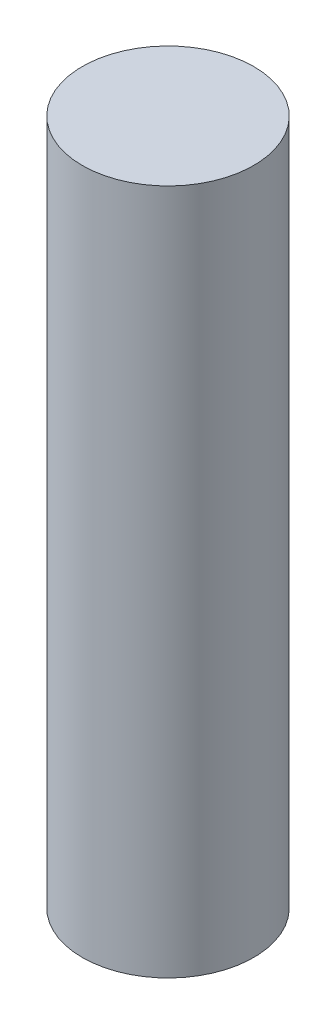
ISO-10303-21;
HEADER;
FILE_DESCRIPTION(('STEP AP214'),'2;1');
FILE_NAME('part.step','',(''),(''),'','','');
FILE_SCHEMA(('AUTOMOTIVE_DESIGN { 1 0 10303 214 1 1 1 1 }'));
ENDSEC;
DATA;
#1=APPLICATION_CONTEXT('core data for automotive mechanical design processes');
#2=APPLICATION_PROTOCOL_DEFINITION('international standard','automotive_design',2000,#1);
#3=PRODUCT_CONTEXT('',#1,'mechanical');
#4=PRODUCT('Part','Part','',(#3));
#5=PRODUCT_RELATED_PRODUCT_CATEGORY('part','',(#4));
#6=PRODUCT_DEFINITION_FORMATION('','',#4);
#7=PRODUCT_DEFINITION_CONTEXT('part definition',#1,'design');
#8=PRODUCT_DEFINITION('design','',#6,#7);
#9=PRODUCT_DEFINITION_SHAPE('','',#8);
#10=(LENGTH_UNIT() NAMED_UNIT(*) SI_UNIT(.MILLI.,.METRE.));
#11=(NAMED_UNIT(*) PLANE_ANGLE_UNIT() SI_UNIT($,.RADIAN.));
#12=(NAMED_UNIT(*) SI_UNIT($,.STERADIAN.) SOLID_ANGLE_UNIT());
#13=UNCERTAINTY_MEASURE_WITH_UNIT(LENGTH_MEASURE(1.E-05),#10,'distance_accuracy_value','');
#14=(GEOMETRIC_REPRESENTATION_CONTEXT(3) GLOBAL_UNCERTAINTY_ASSIGNED_CONTEXT((#13)) GLOBAL_UNIT_ASSIGNED_CONTEXT((#10,
#11,#12)) REPRESENTATION_CONTEXT('',''));
#15=CARTESIAN_POINT('',(0.,0.,0.));
#16=DIRECTION('',(0.,0.,1.));
#17=DIRECTION('',(1.,0.,0.));
#18=AXIS2_PLACEMENT_3D('',#15,#16,#17);
#19=CARTESIAN_POINT('',(0.,50.8,0.));
#20=DIRECTION('',(0.,-1.,0.));
#21=DIRECTION('',(0.,0.,-1.));
#22=AXIS2_PLACEMENT_3D('',#19,#20,#21);
#23=CYLINDRICAL_SURFACE('',#22,6.35);
#24=CARTESIAN_POINT('',(0.,50.8,0.));
#25=DIRECTION('',(0.,1.,0.));
#26=DIRECTION('',(0.,0.,1.));
#27=AXIS2_PLACEMENT_3D('',#24,#25,#26);
#28=CIRCLE('',#27,6.35);
#29=CARTESIAN_POINT('',(0.,50.8,6.35));
#30=VERTEX_POINT('',#29);
#31=EDGE_CURVE('E10',#30,#30,#28,.T.);
#32=ORIENTED_EDGE('',*,*,#31,.F.);
#33=EDGE_LOOP('',(#32));
#34=FACE_BOUND('',#33,.T.);
#35=CARTESIAN_POINT('',(0.,0.,0.));
#36=DIRECTION('',(0.,1.,0.));
#37=DIRECTION('',(0.,0.,1.));
#38=AXIS2_PLACEMENT_3D('',#35,#36,#37);
#39=CIRCLE('',#38,6.35);
#40=CARTESIAN_POINT('',(0.,0.,6.35));
#41=VERTEX_POINT('',#40);
#42=EDGE_CURVE('E31',#41,#41,#39,.T.);
#43=ORIENTED_EDGE('',*,*,#42,.T.);
#44=EDGE_LOOP('',(#43));
#45=FACE_BOUND('',#44,.T.);
#46=ADVANCED_FACE('F28',(#34,#45),#23,.T.);
#47=CARTESIAN_POINT('',(0.,50.8,0.));
#48=DIRECTION('',(0.,1.,0.));
#49=DIRECTION('',(0.,0.,1.));
#50=AXIS2_PLACEMENT_3D('',#47,#48,#49);
#51=PLANE('',#50);
#52=ORIENTED_EDGE('',*,*,#31,.T.);
#53=EDGE_LOOP('',(#52));
#54=FACE_BOUND('',#53,.T.);
#55=ADVANCED_FACE('F43',(#54),#51,.T.);
#56=CARTESIAN_POINT('',(0.,0.,0.));
#57=DIRECTION('',(0.,1.,0.));
#58=DIRECTION('',(0.,0.,1.));
#59=AXIS2_PLACEMENT_3D('',#56,#57,#58);
#60=PLANE('',#59);
#61=ORIENTED_EDGE('',*,*,#42,.F.);
#62=EDGE_LOOP('',(#61));
#63=FACE_BOUND('',#62,.T.);
#64=ADVANCED_FACE('F41',(#63),#60,.F.);
#65=CLOSED_SHELL('',(#46,#55,#64));
#66=MANIFOLD_SOLID_BREP('B2',#65);
#67=ADVANCED_BREP_SHAPE_REPRESENTATION('',(#18,#66),#14);
#68=SHAPE_DEFINITION_REPRESENTATION(#9,#67);
ENDSEC;
END-ISO-10303-21;
